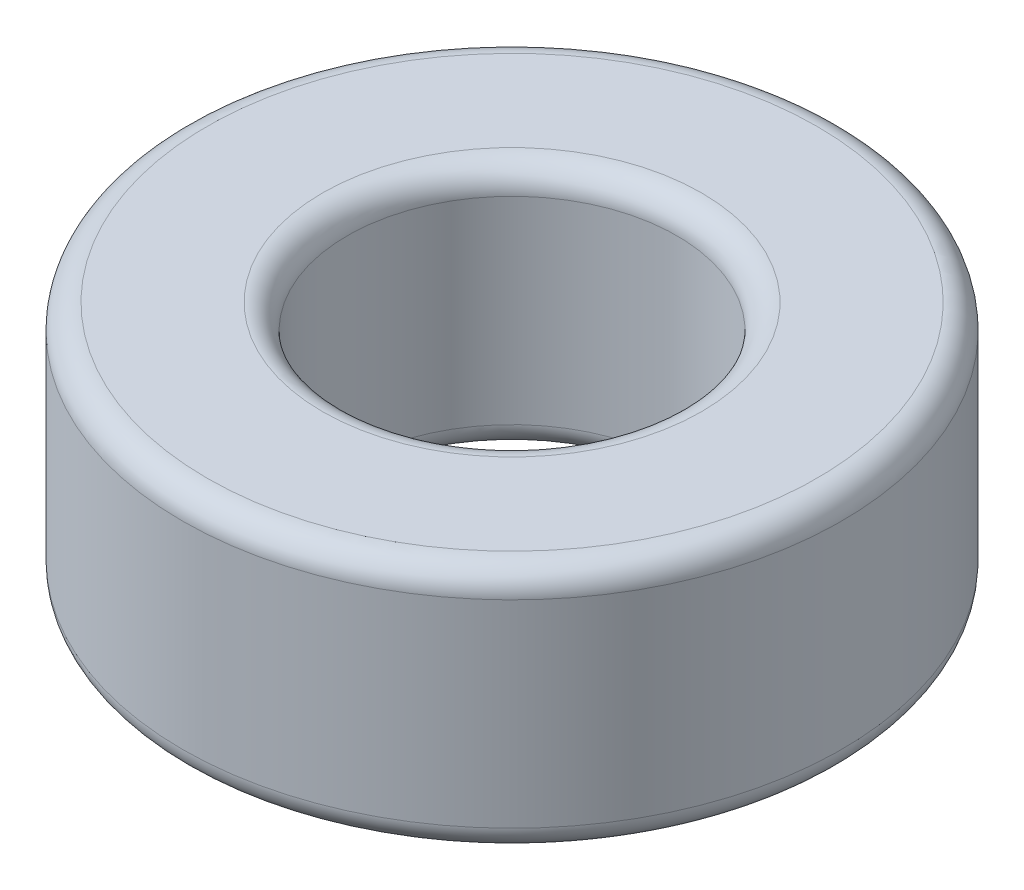
ISO-10303-21;
HEADER;
FILE_DESCRIPTION(('STEP AP214'),'2;1');
FILE_NAME('part.step','',(''),(''),'','','');
FILE_SCHEMA(('AUTOMOTIVE_DESIGN { 1 0 10303 214 1 1 1 1 }'));
ENDSEC;
DATA;
#1=APPLICATION_CONTEXT('core data for automotive mechanical design processes');
#2=APPLICATION_PROTOCOL_DEFINITION('international standard','automotive_design',2000,#1);
#3=PRODUCT_CONTEXT('',#1,'mechanical');
#4=PRODUCT('Part','Part','',(#3));
#5=PRODUCT_RELATED_PRODUCT_CATEGORY('part','',(#4));
#6=PRODUCT_DEFINITION_FORMATION('','',#4);
#7=PRODUCT_DEFINITION_CONTEXT('part definition',#1,'design');
#8=PRODUCT_DEFINITION('design','',#6,#7);
#9=PRODUCT_DEFINITION_SHAPE('','',#8);
#10=(LENGTH_UNIT() NAMED_UNIT(*) SI_UNIT(.MILLI.,.METRE.));
#11=(NAMED_UNIT(*) PLANE_ANGLE_UNIT() SI_UNIT($,.RADIAN.));
#12=(NAMED_UNIT(*) SI_UNIT($,.STERADIAN.) SOLID_ANGLE_UNIT());
#13=UNCERTAINTY_MEASURE_WITH_UNIT(LENGTH_MEASURE(1.E-05),#10,'distance_accuracy_value','');
#14=(GEOMETRIC_REPRESENTATION_CONTEXT(3) GLOBAL_UNCERTAINTY_ASSIGNED_CONTEXT((#13)) GLOBAL_UNIT_ASSIGNED_CONTEXT((#10,
#11,#12)) REPRESENTATION_CONTEXT('',''));
#15=CARTESIAN_POINT('',(0.,0.,0.));
#16=DIRECTION('',(0.,0.,1.));
#17=DIRECTION('',(1.,0.,0.));
#18=AXIS2_PLACEMENT_3D('',#15,#16,#17);
#19=CARTESIAN_POINT('',(0.,4.7625,0.));
#20=DIRECTION('',(0.,1.,0.));
#21=DIRECTION('',(0.,0.,1.));
#22=AXIS2_PLACEMENT_3D('',#19,#20,#21);
#23=PLANE('',#22);
#24=CARTESIAN_POINT('',(0.,4.7625,0.));
#25=DIRECTION('',(0.,1.,0.));
#26=DIRECTION('',(0.,0.,1.));
#27=AXIS2_PLACEMENT_3D('',#24,#25,#26);
#28=CIRCLE('',#27,3.65125);
#29=CARTESIAN_POINT('',(0.,4.7625,3.65125));
#30=VERTEX_POINT('',#29);
#31=EDGE_CURVE('E60',#30,#30,#28,.F.);
#32=ORIENTED_EDGE('',*,*,#31,.T.);
#33=EDGE_LOOP('',(#32));
#34=FACE_BOUND('',#33,.T.);
#35=CARTESIAN_POINT('',(0.,4.7625,0.));
#36=DIRECTION('',(0.,1.,0.));
#37=DIRECTION('',(0.,0.,1.));
#38=AXIS2_PLACEMENT_3D('',#35,#36,#37);
#39=CIRCLE('',#38,5.87375);
#40=CARTESIAN_POINT('',(0.,4.7625,5.87375));
#41=VERTEX_POINT('',#40);
#42=EDGE_CURVE('E58',#41,#41,#39,.T.);
#43=ORIENTED_EDGE('',*,*,#42,.T.);
#44=EDGE_LOOP('',(#43));
#45=FACE_BOUND('',#44,.T.);
#46=ADVANCED_FACE('F40',(#34,#45),#23,.T.);
#47=CARTESIAN_POINT('',(0.,0.,0.));
#48=DIRECTION('',(0.,1.,0.));
#49=DIRECTION('',(0.,0.,1.));
#50=AXIS2_PLACEMENT_3D('',#47,#48,#49);
#51=PLANE('',#50);
#52=CARTESIAN_POINT('',(0.,0.,0.));
#53=DIRECTION('',(0.,1.,0.));
#54=DIRECTION('',(0.,0.,1.));
#55=AXIS2_PLACEMENT_3D('',#52,#53,#54);
#56=CIRCLE('',#55,3.65125);
#57=CARTESIAN_POINT('',(0.,0.,3.65125));
#58=VERTEX_POINT('',#57);
#59=EDGE_CURVE('E10',#58,#58,#56,.T.);
#60=ORIENTED_EDGE('',*,*,#59,.T.);
#61=EDGE_LOOP('',(#60));
#62=FACE_BOUND('',#61,.T.);
#63=CARTESIAN_POINT('',(0.,0.,0.));
#64=DIRECTION('',(0.,1.,0.));
#65=DIRECTION('',(0.,0.,1.));
#66=AXIS2_PLACEMENT_3D('',#63,#64,#65);
#67=CIRCLE('',#66,5.87375);
#68=CARTESIAN_POINT('',(0.,0.,5.87375));
#69=VERTEX_POINT('',#68);
#70=EDGE_CURVE('E42',#69,#69,#67,.F.);
#71=ORIENTED_EDGE('',*,*,#70,.T.);
#72=EDGE_LOOP('',(#71));
#73=FACE_BOUND('',#72,.T.);
#74=ADVANCED_FACE('F81',(#62,#73),#51,.F.);
#75=CARTESIAN_POINT('',(0.,4.7625,0.));
#76=DIRECTION('',(0.,-1.,0.));
#77=DIRECTION('',(0.,0.,-1.));
#78=AXIS2_PLACEMENT_3D('',#75,#76,#77);
#79=CYLINDRICAL_SURFACE('',#78,6.35);
#80=CARTESIAN_POINT('',(0.,4.28625,0.));
#81=DIRECTION('',(0.,1.,0.));
#82=DIRECTION('',(0.,0.,1.));
#83=AXIS2_PLACEMENT_3D('',#80,#81,#82);
#84=CIRCLE('',#83,6.35);
#85=CARTESIAN_POINT('',(0.,4.28625,6.35));
#86=VERTEX_POINT('',#85);
#87=EDGE_CURVE('E48',#86,#86,#84,.F.);
#88=ORIENTED_EDGE('',*,*,#87,.T.);
#89=EDGE_LOOP('',(#88));
#90=FACE_BOUND('',#89,.T.);
#91=CARTESIAN_POINT('',(0.,0.47625,0.));
#92=DIRECTION('',(0.,1.,0.));
#93=DIRECTION('',(0.,0.,1.));
#94=AXIS2_PLACEMENT_3D('',#91,#92,#93);
#95=CIRCLE('',#94,6.35);
#96=CARTESIAN_POINT('',(0.,0.47625,6.35));
#97=VERTEX_POINT('',#96);
#98=EDGE_CURVE('E55',#97,#97,#95,.T.);
#99=ORIENTED_EDGE('',*,*,#98,.T.);
#100=EDGE_LOOP('',(#99));
#101=FACE_BOUND('',#100,.T.);
#102=ADVANCED_FACE('F93',(#90,#101),#79,.T.);
#103=CARTESIAN_POINT('',(0.,4.7625,0.));
#104=DIRECTION('',(0.,-1.,0.));
#105=DIRECTION('',(0.,0.,-1.));
#106=AXIS2_PLACEMENT_3D('',#103,#104,#105);
#107=CYLINDRICAL_SURFACE('',#106,3.175);
#108=CARTESIAN_POINT('',(0.,4.28625,0.));
#109=DIRECTION('',(0.,1.,0.));
#110=DIRECTION('',(0.,0.,1.));
#111=AXIS2_PLACEMENT_3D('',#108,#109,#110);
#112=CIRCLE('',#111,3.175);
#113=CARTESIAN_POINT('',(0.,4.28625,3.175));
#114=VERTEX_POINT('',#113);
#115=EDGE_CURVE('E62',#114,#114,#112,.T.);
#116=ORIENTED_EDGE('',*,*,#115,.T.);
#117=EDGE_LOOP('',(#116));
#118=FACE_BOUND('',#117,.T.);
#119=CARTESIAN_POINT('',(0.,0.47625,0.));
#120=DIRECTION('',(0.,1.,0.));
#121=DIRECTION('',(0.,0.,1.));
#122=AXIS2_PLACEMENT_3D('',#119,#120,#121);
#123=CIRCLE('',#122,3.175);
#124=CARTESIAN_POINT('',(0.,0.47625,3.175));
#125=VERTEX_POINT('',#124);
#126=EDGE_CURVE('E68',#125,#125,#123,.F.);
#127=ORIENTED_EDGE('',*,*,#126,.T.);
#128=EDGE_LOOP('',(#127));
#129=FACE_BOUND('',#128,.T.);
#130=ADVANCED_FACE('F66',(#118,#129),#107,.F.);
#131=CARTESIAN_POINT('',(0.,4.28625,0.));
#132=DIRECTION('',(0.,1.,0.));
#133=DIRECTION('',(0.,0.,1.));
#134=AXIS2_PLACEMENT_3D('',#131,#132,#133);
#135=TOROIDAL_SURFACE('',#134,3.65125,0.47625);
#136=ORIENTED_EDGE('',*,*,#31,.F.);
#137=EDGE_LOOP('',(#136));
#138=FACE_BOUND('',#137,.T.);
#139=ORIENTED_EDGE('',*,*,#115,.F.);
#140=EDGE_LOOP('',(#139));
#141=FACE_BOUND('',#140,.T.);
#142=ADVANCED_FACE('F83',(#138,#141),#135,.T.);
#143=CARTESIAN_POINT('',(0.,4.28625,0.));
#144=DIRECTION('',(0.,1.,0.));
#145=DIRECTION('',(0.,0.,1.));
#146=AXIS2_PLACEMENT_3D('',#143,#144,#145);
#147=TOROIDAL_SURFACE('',#146,5.87375,0.47625);
#148=ORIENTED_EDGE('',*,*,#87,.F.);
#149=EDGE_LOOP('',(#148));
#150=FACE_BOUND('',#149,.T.);
#151=ORIENTED_EDGE('',*,*,#42,.F.);
#152=EDGE_LOOP('',(#151));
#153=FACE_BOUND('',#152,.T.);
#154=ADVANCED_FACE('F73',(#150,#153),#147,.T.);
#155=CARTESIAN_POINT('',(0.,0.47625,0.));
#156=DIRECTION('',(0.,1.,0.));
#157=DIRECTION('',(0.,0.,1.));
#158=AXIS2_PLACEMENT_3D('',#155,#156,#157);
#159=TOROIDAL_SURFACE('',#158,3.65125,0.47625);
#160=ORIENTED_EDGE('',*,*,#126,.F.);
#161=EDGE_LOOP('',(#160));
#162=FACE_BOUND('',#161,.T.);
#163=ORIENTED_EDGE('',*,*,#59,.F.);
#164=EDGE_LOOP('',(#163));
#165=FACE_BOUND('',#164,.T.);
#166=ADVANCED_FACE('F75',(#162,#165),#159,.T.);
#167=CARTESIAN_POINT('',(0.,0.47625,0.));
#168=DIRECTION('',(0.,1.,0.));
#169=DIRECTION('',(0.,0.,1.));
#170=AXIS2_PLACEMENT_3D('',#167,#168,#169);
#171=TOROIDAL_SURFACE('',#170,5.87375,0.47625);
#172=ORIENTED_EDGE('',*,*,#70,.F.);
#173=EDGE_LOOP('',(#172));
#174=FACE_BOUND('',#173,.T.);
#175=ORIENTED_EDGE('',*,*,#98,.F.);
#176=EDGE_LOOP('',(#175));
#177=FACE_BOUND('',#176,.T.);
#178=ADVANCED_FACE('F39',(#174,#177),#171,.T.);
#179=CLOSED_SHELL('',(#46,#74,#102,#130,#142,#154,#166,#178));
#180=MANIFOLD_SOLID_BREP('B2',#179);
#181=ADVANCED_BREP_SHAPE_REPRESENTATION('',(#18,#180),#14);
#182=SHAPE_DEFINITION_REPRESENTATION(#9,#181);
ENDSEC;
END-ISO-10303-21;
